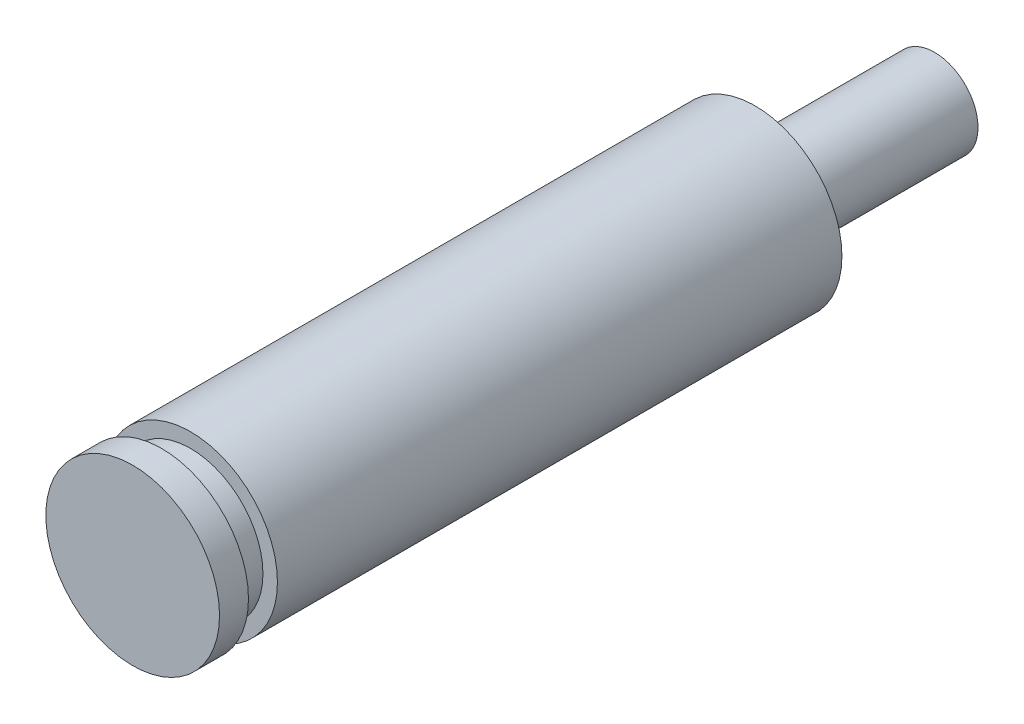
ISO-10303-21;
HEADER;
FILE_DESCRIPTION(('STEP AP214'),'2;1');
FILE_NAME('part.step','',(''),(''),'','','');
FILE_SCHEMA(('AUTOMOTIVE_DESIGN { 1 0 10303 214 1 1 1 1 }'));
ENDSEC;
DATA;
#1=APPLICATION_CONTEXT('core data for automotive mechanical design processes');
#2=APPLICATION_PROTOCOL_DEFINITION('international standard','automotive_design',2000,#1);
#3=PRODUCT_CONTEXT('',#1,'mechanical');
#4=PRODUCT('Part','Part','',(#3));
#5=PRODUCT_RELATED_PRODUCT_CATEGORY('part','',(#4));
#6=PRODUCT_DEFINITION_FORMATION('','',#4);
#7=PRODUCT_DEFINITION_CONTEXT('part definition',#1,'design');
#8=PRODUCT_DEFINITION('design','',#6,#7);
#9=PRODUCT_DEFINITION_SHAPE('','',#8);
#10=(LENGTH_UNIT() NAMED_UNIT(*) SI_UNIT(.MILLI.,.METRE.));
#11=(NAMED_UNIT(*) PLANE_ANGLE_UNIT() SI_UNIT($,.RADIAN.));
#12=(NAMED_UNIT(*) SI_UNIT($,.STERADIAN.) SOLID_ANGLE_UNIT());
#13=UNCERTAINTY_MEASURE_WITH_UNIT(LENGTH_MEASURE(1.E-05),#10,'distance_accuracy_value','');
#14=(GEOMETRIC_REPRESENTATION_CONTEXT(3) GLOBAL_UNCERTAINTY_ASSIGNED_CONTEXT((#13)) GLOBAL_UNIT_ASSIGNED_CONTEXT((#10,
#11,#12)) REPRESENTATION_CONTEXT('',''));
#15=CARTESIAN_POINT('',(0.,0.,0.));
#16=DIRECTION('',(0.,0.,1.));
#17=DIRECTION('',(1.,0.,0.));
#18=AXIS2_PLACEMENT_3D('',#15,#16,#17);
#19=CARTESIAN_POINT('',(3.,0.,0.));
#20=DIRECTION('',(0.,0.,1.));
#21=DIRECTION('',(1.,0.,0.));
#22=AXIS2_PLACEMENT_3D('',#19,#20,#21);
#23=PLANE('',#22);
#24=CARTESIAN_POINT('',(0.,0.,0.));
#25=DIRECTION('',(0.,0.,1.));
#26=DIRECTION('',(1.,0.,0.));
#27=AXIS2_PLACEMENT_3D('',#24,#25,#26);
#28=CIRCLE('',#27,3.);
#29=CARTESIAN_POINT('',(3.,0.,0.));
#30=VERTEX_POINT('',#29);
#31=EDGE_CURVE('E63',#30,#30,#28,.T.);
#32=ORIENTED_EDGE('',*,*,#31,.T.);
#33=EDGE_LOOP('',(#32));
#34=FACE_BOUND('',#33,.T.);
#35=ADVANCED_FACE('F35',(#34),#23,.T.);
#36=CARTESIAN_POINT('',(0.,0.,-27.7));
#37=DIRECTION('',(0.,0.,-1.));
#38=DIRECTION('',(-1.,0.,0.));
#39=AXIS2_PLACEMENT_3D('',#36,#37,#38);
#40=PLANE('',#39);
#41=CARTESIAN_POINT('',(0.,0.,-27.7));
#42=DIRECTION('',(0.,0.,1.));
#43=DIRECTION('',(1.,0.,0.));
#44=AXIS2_PLACEMENT_3D('',#41,#42,#43);
#45=CIRCLE('',#44,1.5);
#46=CARTESIAN_POINT('',(1.5,0.,-27.7));
#47=VERTEX_POINT('',#46);
#48=EDGE_CURVE('E10',#47,#47,#45,.T.);
#49=ORIENTED_EDGE('',*,*,#48,.F.);
#50=EDGE_LOOP('',(#49));
#51=FACE_BOUND('',#50,.T.);
#52=ADVANCED_FACE('F80',(#51),#40,.T.);
#53=CARTESIAN_POINT('',(0.,0.,0.));
#54=DIRECTION('',(0.,0.,1.));
#55=DIRECTION('',(1.,0.,0.));
#56=AXIS2_PLACEMENT_3D('',#53,#54,#55);
#57=CYLINDRICAL_SURFACE('',#56,1.5);
#58=ORIENTED_EDGE('',*,*,#48,.T.);
#59=EDGE_LOOP('',(#58));
#60=FACE_BOUND('',#59,.T.);
#61=CARTESIAN_POINT('',(0.,0.,-21.5));
#62=DIRECTION('',(0.,0.,1.));
#63=DIRECTION('',(1.,0.,0.));
#64=AXIS2_PLACEMENT_3D('',#61,#62,#63);
#65=CIRCLE('',#64,1.5);
#66=CARTESIAN_POINT('',(1.5,0.,-21.5));
#67=VERTEX_POINT('',#66);
#68=EDGE_CURVE('E41',#67,#67,#65,.T.);
#69=ORIENTED_EDGE('',*,*,#68,.F.);
#70=EDGE_LOOP('',(#69));
#71=FACE_BOUND('',#70,.T.);
#72=ADVANCED_FACE('F84',(#60,#71),#57,.T.);
#73=CARTESIAN_POINT('',(1.5,0.,-21.5));
#74=DIRECTION('',(0.,0.,-1.));
#75=DIRECTION('',(-1.,0.,0.));
#76=AXIS2_PLACEMENT_3D('',#73,#74,#75);
#77=PLANE('',#76);
#78=ORIENTED_EDGE('',*,*,#68,.T.);
#79=EDGE_LOOP('',(#78));
#80=FACE_BOUND('',#79,.T.);
#81=CARTESIAN_POINT('',(0.,0.,-21.5));
#82=DIRECTION('',(0.,0.,1.));
#83=DIRECTION('',(1.,0.,0.));
#84=AXIS2_PLACEMENT_3D('',#81,#82,#83);
#85=CIRCLE('',#84,3.);
#86=CARTESIAN_POINT('',(3.,0.,-21.5));
#87=VERTEX_POINT('',#86);
#88=EDGE_CURVE('E45',#87,#87,#85,.T.);
#89=ORIENTED_EDGE('',*,*,#88,.F.);
#90=EDGE_LOOP('',(#89));
#91=FACE_BOUND('',#90,.T.);
#92=ADVANCED_FACE('F89',(#80,#91),#77,.T.);
#93=CARTESIAN_POINT('',(0.,0.,0.));
#94=DIRECTION('',(0.,0.,1.));
#95=DIRECTION('',(1.,0.,0.));
#96=AXIS2_PLACEMENT_3D('',#93,#94,#95);
#97=CYLINDRICAL_SURFACE('',#96,3.);
#98=ORIENTED_EDGE('',*,*,#88,.T.);
#99=EDGE_LOOP('',(#98));
#100=FACE_BOUND('',#99,.T.);
#101=CARTESIAN_POINT('',(0.,0.,-2.));
#102=DIRECTION('',(0.,0.,1.));
#103=DIRECTION('',(1.,0.,0.));
#104=AXIS2_PLACEMENT_3D('',#101,#102,#103);
#105=CIRCLE('',#104,3.);
#106=CARTESIAN_POINT('',(3.,0.,-2.));
#107=VERTEX_POINT('',#106);
#108=EDGE_CURVE('E49',#107,#107,#105,.T.);
#109=ORIENTED_EDGE('',*,*,#108,.F.);
#110=EDGE_LOOP('',(#109));
#111=FACE_BOUND('',#110,.T.);
#112=ADVANCED_FACE('F94',(#100,#111),#97,.T.);
#113=CARTESIAN_POINT('',(3.,0.,-2.));
#114=DIRECTION('',(0.,0.,1.));
#115=DIRECTION('',(1.,0.,0.));
#116=AXIS2_PLACEMENT_3D('',#113,#114,#115);
#117=PLANE('',#116);
#118=ORIENTED_EDGE('',*,*,#108,.T.);
#119=EDGE_LOOP('',(#118));
#120=FACE_BOUND('',#119,.T.);
#121=CARTESIAN_POINT('',(0.,0.,-2.));
#122=DIRECTION('',(0.,0.,1.));
#123=DIRECTION('',(1.,0.,0.));
#124=AXIS2_PLACEMENT_3D('',#121,#122,#123);
#125=CIRCLE('',#124,2.5);
#126=CARTESIAN_POINT('',(2.5,0.,-2.));
#127=VERTEX_POINT('',#126);
#128=EDGE_CURVE('E54',#127,#127,#125,.T.);
#129=ORIENTED_EDGE('',*,*,#128,.F.);
#130=EDGE_LOOP('',(#129));
#131=FACE_BOUND('',#130,.T.);
#132=ADVANCED_FACE('F97',(#120,#131),#117,.T.);
#133=CARTESIAN_POINT('',(0.,0.,0.));
#134=DIRECTION('',(0.,0.,1.));
#135=DIRECTION('',(1.,0.,0.));
#136=AXIS2_PLACEMENT_3D('',#133,#134,#135);
#137=CYLINDRICAL_SURFACE('',#136,2.5);
#138=ORIENTED_EDGE('',*,*,#128,.T.);
#139=EDGE_LOOP('',(#138));
#140=FACE_BOUND('',#139,.T.);
#141=CARTESIAN_POINT('',(0.,0.,-1.));
#142=DIRECTION('',(0.,0.,1.));
#143=DIRECTION('',(1.,0.,0.));
#144=AXIS2_PLACEMENT_3D('',#141,#142,#143);
#145=CIRCLE('',#144,2.5);
#146=CARTESIAN_POINT('',(2.5,0.,-1.));
#147=VERTEX_POINT('',#146);
#148=EDGE_CURVE('E57',#147,#147,#145,.T.);
#149=ORIENTED_EDGE('',*,*,#148,.F.);
#150=EDGE_LOOP('',(#149));
#151=FACE_BOUND('',#150,.T.);
#152=ADVANCED_FACE('F76',(#140,#151),#137,.T.);
#153=CARTESIAN_POINT('',(2.5,0.,-1.));
#154=DIRECTION('',(0.,0.,-1.));
#155=DIRECTION('',(-1.,0.,0.));
#156=AXIS2_PLACEMENT_3D('',#153,#154,#155);
#157=PLANE('',#156);
#158=ORIENTED_EDGE('',*,*,#148,.T.);
#159=EDGE_LOOP('',(#158));
#160=FACE_BOUND('',#159,.T.);
#161=CARTESIAN_POINT('',(0.,0.,-1.));
#162=DIRECTION('',(0.,0.,1.));
#163=DIRECTION('',(1.,0.,0.));
#164=AXIS2_PLACEMENT_3D('',#161,#162,#163);
#165=CIRCLE('',#164,3.);
#166=CARTESIAN_POINT('',(3.,0.,-1.));
#167=VERTEX_POINT('',#166);
#168=EDGE_CURVE('E60',#167,#167,#165,.T.);
#169=ORIENTED_EDGE('',*,*,#168,.F.);
#170=EDGE_LOOP('',(#169));
#171=FACE_BOUND('',#170,.T.);
#172=ADVANCED_FACE('F70',(#160,#171),#157,.T.);
#173=CARTESIAN_POINT('',(0.,0.,0.));
#174=DIRECTION('',(0.,0.,1.));
#175=DIRECTION('',(1.,0.,0.));
#176=AXIS2_PLACEMENT_3D('',#173,#174,#175);
#177=CYLINDRICAL_SURFACE('',#176,3.);
#178=ORIENTED_EDGE('',*,*,#168,.T.);
#179=EDGE_LOOP('',(#178));
#180=FACE_BOUND('',#179,.T.);
#181=ORIENTED_EDGE('',*,*,#31,.F.);
#182=EDGE_LOOP('',(#181));
#183=FACE_BOUND('',#182,.T.);
#184=ADVANCED_FACE('F68',(#180,#183),#177,.T.);
#185=CLOSED_SHELL('',(#35,#52,#72,#92,#112,#132,#152,#172,#184));
#186=MANIFOLD_SOLID_BREP('B2',#185);
#187=ADVANCED_BREP_SHAPE_REPRESENTATION('',(#18,#186),#14);
#188=SHAPE_DEFINITION_REPRESENTATION(#9,#187);
ENDSEC;
END-ISO-10303-21;
